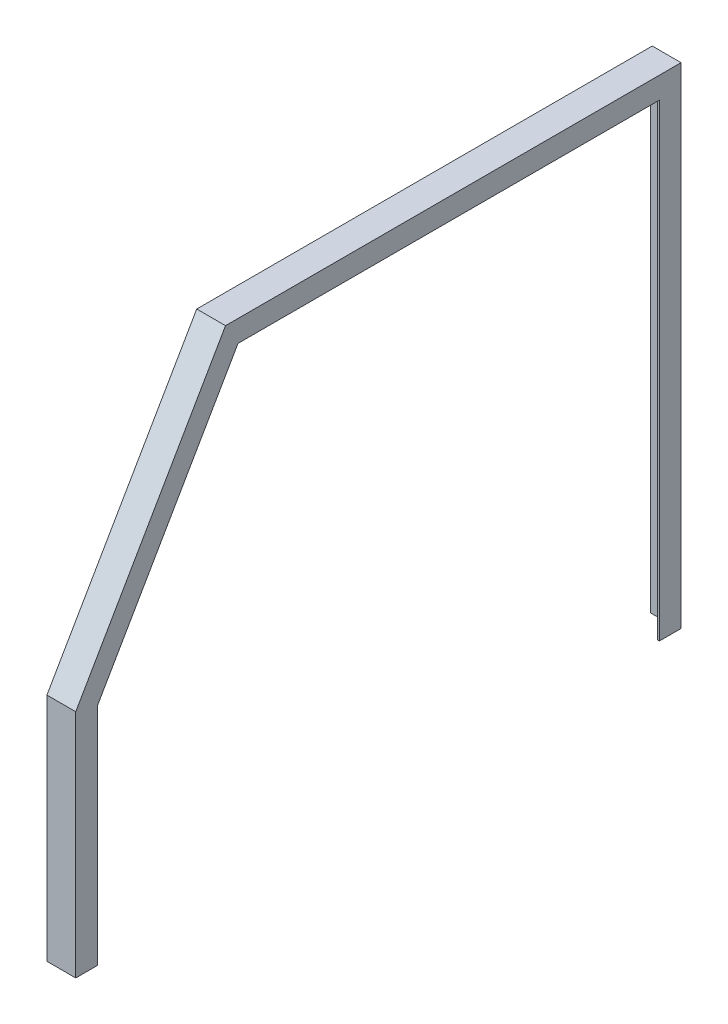
ISO-10303-21;
HEADER;
FILE_DESCRIPTION(('STEP AP214'),'2;1');
FILE_NAME('part.step','',(''),(''),'','','');
FILE_SCHEMA(('AUTOMOTIVE_DESIGN { 1 0 10303 214 1 1 1 1 }'));
ENDSEC;
DATA;
#1=APPLICATION_CONTEXT('core data for automotive mechanical design processes');
#2=APPLICATION_PROTOCOL_DEFINITION('international standard','automotive_design',2000,#1);
#3=PRODUCT_CONTEXT('',#1,'mechanical');
#4=PRODUCT('Part','Part','',(#3));
#5=PRODUCT_RELATED_PRODUCT_CATEGORY('part','',(#4));
#6=PRODUCT_DEFINITION_FORMATION('','',#4);
#7=PRODUCT_DEFINITION_CONTEXT('part definition',#1,'design');
#8=PRODUCT_DEFINITION('design','',#6,#7);
#9=PRODUCT_DEFINITION_SHAPE('','',#8);
#10=(LENGTH_UNIT() NAMED_UNIT(*) SI_UNIT(.MILLI.,.METRE.));
#11=(NAMED_UNIT(*) PLANE_ANGLE_UNIT() SI_UNIT($,.RADIAN.));
#12=(NAMED_UNIT(*) SI_UNIT($,.STERADIAN.) SOLID_ANGLE_UNIT());
#13=UNCERTAINTY_MEASURE_WITH_UNIT(LENGTH_MEASURE(1.E-05),#10,'distance_accuracy_value','');
#14=(GEOMETRIC_REPRESENTATION_CONTEXT(3) GLOBAL_UNCERTAINTY_ASSIGNED_CONTEXT((#13)) GLOBAL_UNIT_ASSIGNED_CONTEXT((#10,
#11,#12)) REPRESENTATION_CONTEXT('',''));
#15=CARTESIAN_POINT('',(0.,0.,0.));
#16=DIRECTION('',(0.,0.,1.));
#17=DIRECTION('',(1.,0.,0.));
#18=AXIS2_PLACEMENT_3D('',#15,#16,#17);
#19=CARTESIAN_POINT('',(3.175,0.,495.3));
#20=DIRECTION('',(0.,1.,0.));
#21=DIRECTION('',(0.,0.,1.));
#22=AXIS2_PLACEMENT_3D('',#19,#20,#21);
#23=PLANE('',#22);
#24=DIRECTION('',(-1.,0.,0.));
#25=VECTOR('',#24,1.);
#26=CARTESIAN_POINT('',(3.175,0.,533.4));
#27=LINE('',#26,#25);
#28=CARTESIAN_POINT('',(3.175,0.,533.4));
#29=VERTEX_POINT('',#28);
#30=CARTESIAN_POINT('',(-47.625,0.,533.4));
#31=VERTEX_POINT('',#30);
#32=EDGE_CURVE('E150',#29,#31,#27,.T.);
#33=ORIENTED_EDGE('',*,*,#32,.T.);
#34=DIRECTION('',(0.,0.,1.));
#35=VECTOR('',#34,1.);
#36=CARTESIAN_POINT('',(-47.625,0.,530.225));
#37=LINE('',#36,#35);
#38=CARTESIAN_POINT('',(-47.625,0.,530.225));
#39=VERTEX_POINT('',#38);
#40=EDGE_CURVE('E164',#39,#31,#37,.T.);
#41=ORIENTED_EDGE('',*,*,#40,.F.);
#42=DIRECTION('',(1.,0.,0.));
#43=VECTOR('',#42,1.);
#44=CARTESIAN_POINT('',(-47.625,0.,530.225));
#45=LINE('',#44,#43);
#46=CARTESIAN_POINT('',(0.,0.,530.225));
#47=VERTEX_POINT('',#46);
#48=EDGE_CURVE('E183',#39,#47,#45,.T.);
#49=ORIENTED_EDGE('',*,*,#48,.T.);
#50=DIRECTION('',(0.,0.,-1.));
#51=VECTOR('',#50,1.);
#52=CARTESIAN_POINT('',(0.,0.,495.3));
#53=LINE('',#52,#51);
#54=CARTESIAN_POINT('',(0.,0.,495.3));
#55=VERTEX_POINT('',#54);
#56=EDGE_CURVE('E238',#47,#55,#53,.T.);
#57=ORIENTED_EDGE('',*,*,#56,.T.);
#58=DIRECTION('',(-1.,0.,0.));
#59=VECTOR('',#58,1.);
#60=CARTESIAN_POINT('',(3.175,0.,495.3));
#61=LINE('',#60,#59);
#62=CARTESIAN_POINT('',(3.175,0.,495.3));
#63=VERTEX_POINT('',#62);
#64=EDGE_CURVE('E11',#63,#55,#61,.T.);
#65=ORIENTED_EDGE('',*,*,#64,.F.);
#66=DIRECTION('',(0.,0.,-1.));
#67=VECTOR('',#66,1.);
#68=CARTESIAN_POINT('',(3.175,0.,495.3));
#69=LINE('',#68,#67);
#70=EDGE_CURVE('E212',#29,#63,#69,.T.);
#71=ORIENTED_EDGE('',*,*,#70,.F.);
#72=EDGE_LOOP('',(#33,#41,#49,#57,#65,#71));
#73=FACE_BOUND('',#72,.T.);
#74=ADVANCED_FACE('F33',(#73),#23,.F.);
#75=CARTESIAN_POINT('',(3.175,0.,495.3));
#76=DIRECTION('',(0.,0.,1.));
#77=DIRECTION('',(1.,0.,0.));
#78=AXIS2_PLACEMENT_3D('',#75,#76,#77);
#79=PLANE('',#78);
#80=DIRECTION('',(0.,1.,0.));
#81=VECTOR('',#80,1.);
#82=CARTESIAN_POINT('',(0.,0.,495.3));
#83=LINE('',#82,#81);
#84=CARTESIAN_POINT('',(0.,396.191135768374,495.3));
#85=VERTEX_POINT('',#84);
#86=EDGE_CURVE('E235',#55,#85,#83,.T.);
#87=ORIENTED_EDGE('',*,*,#86,.T.);
#88=DIRECTION('',(-1.,0.,0.));
#89=VECTOR('',#88,1.);
#90=CARTESIAN_POINT('',(3.175,396.191135768374,495.3));
#91=LINE('',#90,#89);
#92=CARTESIAN_POINT('',(3.175,396.191135768374,495.3));
#93=VERTEX_POINT('',#92);
#94=EDGE_CURVE('E41',#93,#85,#91,.T.);
#95=ORIENTED_EDGE('',*,*,#94,.F.);
#96=DIRECTION('',(0.,1.,0.));
#97=VECTOR('',#96,1.);
#98=CARTESIAN_POINT('',(3.175,0.,495.3));
#99=LINE('',#98,#97);
#100=EDGE_CURVE('E215',#63,#93,#99,.T.);
#101=ORIENTED_EDGE('',*,*,#100,.F.);
#102=ORIENTED_EDGE('',*,*,#64,.T.);
#103=EDGE_LOOP('',(#87,#95,#101,#102));
#104=FACE_BOUND('',#103,.T.);
#105=ADVANCED_FACE('F278',(#104),#79,.F.);
#106=CARTESIAN_POINT('',(3.175,396.191135768374,495.3));
#107=DIRECTION('',(0.,0.500000000000001,0.866025403784438));
#108=DIRECTION('',(0.,-0.866025403784438,0.500000000000001));
#109=AXIS2_PLACEMENT_3D('',#106,#107,#108);
#110=PLANE('',#109);
#111=DIRECTION('',(0.,0.866025403784438,-0.500000000000001));
#112=VECTOR('',#111,1.);
#113=CARTESIAN_POINT('',(0.,396.191135768374,495.3));
#114=LINE('',#113,#112);
#115=CARTESIAN_POINT('',(0.,825.5,247.438411670378));
#116=VERTEX_POINT('',#115);
#117=EDGE_CURVE('E271',#85,#116,#114,.T.);
#118=ORIENTED_EDGE('',*,*,#117,.T.);
#119=DIRECTION('',(-1.,0.,0.));
#120=VECTOR('',#119,1.);
#121=CARTESIAN_POINT('',(3.175,825.5,247.438411670378));
#122=LINE('',#121,#120);
#123=CARTESIAN_POINT('',(3.175,825.5,247.438411670378));
#124=VERTEX_POINT('',#123);
#125=EDGE_CURVE('E262',#124,#116,#122,.T.);
#126=ORIENTED_EDGE('',*,*,#125,.F.);
#127=DIRECTION('',(0.,0.866025403784438,-0.500000000000001));
#128=VECTOR('',#127,1.);
#129=CARTESIAN_POINT('',(3.175,396.191135768374,495.3));
#130=LINE('',#129,#128);
#131=EDGE_CURVE('E218',#93,#124,#130,.T.);
#132=ORIENTED_EDGE('',*,*,#131,.F.);
#133=ORIENTED_EDGE('',*,*,#94,.T.);
#134=EDGE_LOOP('',(#118,#126,#132,#133));
#135=FACE_BOUND('',#134,.T.);
#136=ADVANCED_FACE('F269',(#135),#110,.F.);
#137=CARTESIAN_POINT('',(3.175,825.5,247.438411670378));
#138=DIRECTION('',(0.,1.,0.));
#139=DIRECTION('',(0.,0.,1.));
#140=AXIS2_PLACEMENT_3D('',#137,#138,#139);
#141=PLANE('',#140);
#142=DIRECTION('',(0.,0.,-1.));
#143=VECTOR('',#142,1.);
#144=CARTESIAN_POINT('',(0.,825.5,247.438411670378));
#145=LINE('',#144,#143);
#146=CARTESIAN_POINT('',(0.,825.5,-495.3));
#147=VERTEX_POINT('',#146);
#148=EDGE_CURVE('E277',#116,#147,#145,.T.);
#149=ORIENTED_EDGE('',*,*,#148,.T.);
#150=DIRECTION('',(-1.,0.,0.));
#151=VECTOR('',#150,1.);
#152=CARTESIAN_POINT('',(3.175,825.5,-495.3));
#153=LINE('',#152,#151);
#154=CARTESIAN_POINT('',(3.175,825.5,-495.3));
#155=VERTEX_POINT('',#154);
#156=EDGE_CURVE('E259',#155,#147,#153,.T.);
#157=ORIENTED_EDGE('',*,*,#156,.F.);
#158=DIRECTION('',(0.,0.,-1.));
#159=VECTOR('',#158,1.);
#160=CARTESIAN_POINT('',(3.175,825.5,247.438411670378));
#161=LINE('',#160,#159);
#162=EDGE_CURVE('E220',#124,#155,#161,.T.);
#163=ORIENTED_EDGE('',*,*,#162,.F.);
#164=ORIENTED_EDGE('',*,*,#125,.T.);
#165=EDGE_LOOP('',(#149,#157,#163,#164));
#166=FACE_BOUND('',#165,.T.);
#167=ADVANCED_FACE('F304',(#166),#141,.F.);
#168=CARTESIAN_POINT('',(3.175,825.5,-495.3));
#169=DIRECTION('',(0.,0.,-1.));
#170=DIRECTION('',(0.,1.,0.));
#171=AXIS2_PLACEMENT_3D('',#168,#169,#170);
#172=PLANE('',#171);
#173=DIRECTION('',(0.,-1.,0.));
#174=VECTOR('',#173,1.);
#175=CARTESIAN_POINT('',(0.,825.5,-495.3));
#176=LINE('',#175,#174);
#177=CARTESIAN_POINT('',(0.,0.,-495.3));
#178=VERTEX_POINT('',#177);
#179=EDGE_CURVE('E244',#147,#178,#176,.T.);
#180=ORIENTED_EDGE('',*,*,#179,.T.);
#181=DIRECTION('',(-1.,0.,0.));
#182=VECTOR('',#181,1.);
#183=CARTESIAN_POINT('',(3.175,0.,-495.3));
#184=LINE('',#183,#182);
#185=CARTESIAN_POINT('',(3.175,0.,-495.3));
#186=VERTEX_POINT('',#185);
#187=EDGE_CURVE('E256',#186,#178,#184,.T.);
#188=ORIENTED_EDGE('',*,*,#187,.F.);
#189=DIRECTION('',(0.,-1.,0.));
#190=VECTOR('',#189,1.);
#191=CARTESIAN_POINT('',(3.175,825.5,-495.3));
#192=LINE('',#191,#190);
#193=EDGE_CURVE('E222',#155,#186,#192,.T.);
#194=ORIENTED_EDGE('',*,*,#193,.F.);
#195=ORIENTED_EDGE('',*,*,#156,.T.);
#196=EDGE_LOOP('',(#180,#188,#194,#195));
#197=FACE_BOUND('',#196,.T.);
#198=ADVANCED_FACE('F309',(#197),#172,.F.);
#199=CARTESIAN_POINT('',(3.175,0.,-533.4));
#200=DIRECTION('',(0.,1.,0.));
#201=DIRECTION('',(0.,0.,1.));
#202=AXIS2_PLACEMENT_3D('',#199,#200,#201);
#203=PLANE('',#202);
#204=DIRECTION('',(0.,0.,-1.));
#205=VECTOR('',#204,1.);
#206=CARTESIAN_POINT('',(0.,0.,-533.4));
#207=LINE('',#206,#205);
#208=CARTESIAN_POINT('',(0.,0.,-530.225));
#209=VERTEX_POINT('',#208);
#210=EDGE_CURVE('E216',#178,#209,#207,.T.);
#211=ORIENTED_EDGE('',*,*,#210,.T.);
#212=DIRECTION('',(1.,0.,0.));
#213=VECTOR('',#212,1.);
#214=CARTESIAN_POINT('',(-47.625,0.,-530.225));
#215=LINE('',#214,#213);
#216=CARTESIAN_POINT('',(-47.625,0.,-530.225));
#217=VERTEX_POINT('',#216);
#218=EDGE_CURVE('E209',#217,#209,#215,.T.);
#219=ORIENTED_EDGE('',*,*,#218,.F.);
#220=DIRECTION('',(0.,0.,1.));
#221=VECTOR('',#220,1.);
#222=CARTESIAN_POINT('',(-47.625,0.,-533.4));
#223=LINE('',#222,#221);
#224=CARTESIAN_POINT('',(-47.625,0.,-533.4));
#225=VERTEX_POINT('',#224);
#226=EDGE_CURVE('E172',#225,#217,#223,.T.);
#227=ORIENTED_EDGE('',*,*,#226,.F.);
#228=DIRECTION('',(-1.,0.,0.));
#229=VECTOR('',#228,1.);
#230=CARTESIAN_POINT('',(3.175,0.,-533.4));
#231=LINE('',#230,#229);
#232=CARTESIAN_POINT('',(3.175,0.,-533.4));
#233=VERTEX_POINT('',#232);
#234=EDGE_CURVE('E254',#233,#225,#231,.T.);
#235=ORIENTED_EDGE('',*,*,#234,.F.);
#236=DIRECTION('',(0.,0.,-1.));
#237=VECTOR('',#236,1.);
#238=CARTESIAN_POINT('',(3.175,0.,-533.4));
#239=LINE('',#238,#237);
#240=EDGE_CURVE('E224',#186,#233,#239,.T.);
#241=ORIENTED_EDGE('',*,*,#240,.F.);
#242=ORIENTED_EDGE('',*,*,#187,.T.);
#243=EDGE_LOOP('',(#211,#219,#227,#235,#241,#242));
#244=FACE_BOUND('',#243,.T.);
#245=ADVANCED_FACE('F313',(#244),#203,.F.);
#246=CARTESIAN_POINT('',(3.175,863.6,-533.4));
#247=DIRECTION('',(0.,0.,1.));
#248=DIRECTION('',(1.,0.,0.));
#249=AXIS2_PLACEMENT_3D('',#246,#247,#248);
#250=PLANE('',#249);
#251=ORIENTED_EDGE('',*,*,#234,.T.);
#252=DIRECTION('',(0.,-1.,0.));
#253=VECTOR('',#252,1.);
#254=CARTESIAN_POINT('',(-47.625,863.6,-533.4));
#255=LINE('',#254,#253);
#256=CARTESIAN_POINT('',(-47.625,863.6,-533.4));
#257=VERTEX_POINT('',#256);
#258=EDGE_CURVE('E169',#257,#225,#255,.T.);
#259=ORIENTED_EDGE('',*,*,#258,.F.);
#260=DIRECTION('',(-1.,0.,0.));
#261=VECTOR('',#260,1.);
#262=CARTESIAN_POINT('',(3.175,863.6,-533.4));
#263=LINE('',#262,#261);
#264=CARTESIAN_POINT('',(3.175,863.6,-533.4));
#265=VERTEX_POINT('',#264);
#266=EDGE_CURVE('E252',#265,#257,#263,.T.);
#267=ORIENTED_EDGE('',*,*,#266,.F.);
#268=DIRECTION('',(0.,1.,0.));
#269=VECTOR('',#268,1.);
#270=CARTESIAN_POINT('',(3.175,863.6,-533.4));
#271=LINE('',#270,#269);
#272=EDGE_CURVE('E226',#233,#265,#271,.T.);
#273=ORIENTED_EDGE('',*,*,#272,.F.);
#274=EDGE_LOOP('',(#251,#259,#267,#273));
#275=FACE_BOUND('',#274,.T.);
#276=ADVANCED_FACE('F316',(#275),#250,.F.);
#277=CARTESIAN_POINT('',(3.175,863.6,269.435456926503));
#278=DIRECTION('',(0.,-1.,0.));
#279=DIRECTION('',(0.,0.,-1.));
#280=AXIS2_PLACEMENT_3D('',#277,#278,#279);
#281=PLANE('',#280);
#282=ORIENTED_EDGE('',*,*,#266,.T.);
#283=DIRECTION('',(0.,0.,-1.));
#284=VECTOR('',#283,1.);
#285=CARTESIAN_POINT('',(-47.625,863.6,269.435456926503));
#286=LINE('',#285,#284);
#287=CARTESIAN_POINT('',(-47.625,863.6,269.435456926503));
#288=VERTEX_POINT('',#287);
#289=EDGE_CURVE('E159',#288,#257,#286,.T.);
#290=ORIENTED_EDGE('',*,*,#289,.F.);
#291=DIRECTION('',(-1.,0.,0.));
#292=VECTOR('',#291,1.);
#293=CARTESIAN_POINT('',(3.175,863.6,269.435456926503));
#294=LINE('',#293,#292);
#295=CARTESIAN_POINT('',(3.175,863.6,269.435456926503));
#296=VERTEX_POINT('',#295);
#297=EDGE_CURVE('E149',#296,#288,#294,.T.);
#298=ORIENTED_EDGE('',*,*,#297,.F.);
#299=DIRECTION('',(0.,0.,1.));
#300=VECTOR('',#299,1.);
#301=CARTESIAN_POINT('',(3.175,863.6,269.435456926503));
#302=LINE('',#301,#300);
#303=EDGE_CURVE('E228',#265,#296,#302,.T.);
#304=ORIENTED_EDGE('',*,*,#303,.F.);
#305=EDGE_LOOP('',(#282,#290,#298,#304));
#306=FACE_BOUND('',#305,.T.);
#307=ADVANCED_FACE('F320',(#306),#281,.F.);
#308=CARTESIAN_POINT('',(3.175,406.4,533.4));
#309=DIRECTION('',(0.,-0.500000000000001,-0.866025403784438));
#310=DIRECTION('',(0.,0.866025403784438,-0.500000000000001));
#311=AXIS2_PLACEMENT_3D('',#308,#309,#310);
#312=PLANE('',#311);
#313=ORIENTED_EDGE('',*,*,#297,.T.);
#314=DIRECTION('',(0.,0.866025403784438,-0.500000000000001));
#315=VECTOR('',#314,1.);
#316=CARTESIAN_POINT('',(-47.625,406.4,533.4));
#317=LINE('',#316,#315);
#318=CARTESIAN_POINT('',(-47.625,406.4,533.4));
#319=VERTEX_POINT('',#318);
#320=EDGE_CURVE('E153',#319,#288,#317,.T.);
#321=ORIENTED_EDGE('',*,*,#320,.F.);
#322=DIRECTION('',(-1.,0.,0.));
#323=VECTOR('',#322,1.);
#324=CARTESIAN_POINT('',(3.175,406.4,533.4));
#325=LINE('',#324,#323);
#326=CARTESIAN_POINT('',(3.175,406.4,533.4));
#327=VERTEX_POINT('',#326);
#328=EDGE_CURVE('E140',#327,#319,#325,.T.);
#329=ORIENTED_EDGE('',*,*,#328,.F.);
#330=DIRECTION('',(0.,-0.866025403784438,0.500000000000001));
#331=VECTOR('',#330,1.);
#332=CARTESIAN_POINT('',(3.175,406.4,533.4));
#333=LINE('',#332,#331);
#334=EDGE_CURVE('E230',#296,#327,#333,.T.);
#335=ORIENTED_EDGE('',*,*,#334,.F.);
#336=EDGE_LOOP('',(#313,#321,#329,#335));
#337=FACE_BOUND('',#336,.T.);
#338=ADVANCED_FACE('F154',(#337),#312,.F.);
#339=CARTESIAN_POINT('',(3.175,0.,533.4));
#340=DIRECTION('',(0.,0.,-1.));
#341=DIRECTION('',(-1.,0.,0.));
#342=AXIS2_PLACEMENT_3D('',#339,#340,#341);
#343=PLANE('',#342);
#344=ORIENTED_EDGE('',*,*,#328,.T.);
#345=DIRECTION('',(0.,1.,0.));
#346=VECTOR('',#345,1.);
#347=CARTESIAN_POINT('',(-47.625,0.,533.4));
#348=LINE('',#347,#346);
#349=EDGE_CURVE('E145',#31,#319,#348,.T.);
#350=ORIENTED_EDGE('',*,*,#349,.F.);
#351=ORIENTED_EDGE('',*,*,#32,.F.);
#352=DIRECTION('',(0.,-1.,0.));
#353=VECTOR('',#352,1.);
#354=CARTESIAN_POINT('',(3.175,0.,533.4));
#355=LINE('',#354,#353);
#356=EDGE_CURVE('E146',#327,#29,#355,.T.);
#357=ORIENTED_EDGE('',*,*,#356,.F.);
#358=EDGE_LOOP('',(#344,#350,#351,#357));
#359=FACE_BOUND('',#358,.T.);
#360=ADVANCED_FACE('F142',(#359),#343,.F.);
#361=CARTESIAN_POINT('',(3.175,0.,0.));
#362=DIRECTION('',(-1.,0.,0.));
#363=DIRECTION('',(0.,0.,1.));
#364=AXIS2_PLACEMENT_3D('',#361,#362,#363);
#365=PLANE('',#364);
#366=ORIENTED_EDGE('',*,*,#70,.T.);
#367=ORIENTED_EDGE('',*,*,#100,.T.);
#368=ORIENTED_EDGE('',*,*,#131,.T.);
#369=ORIENTED_EDGE('',*,*,#162,.T.);
#370=ORIENTED_EDGE('',*,*,#193,.T.);
#371=ORIENTED_EDGE('',*,*,#240,.T.);
#372=ORIENTED_EDGE('',*,*,#272,.T.);
#373=ORIENTED_EDGE('',*,*,#303,.T.);
#374=ORIENTED_EDGE('',*,*,#334,.T.);
#375=ORIENTED_EDGE('',*,*,#356,.T.);
#376=EDGE_LOOP('',(#366,#367,#368,#369,#370,#371,#372,#373,#374,#375));
#377=FACE_BOUND('',#376,.T.);
#378=ADVANCED_FACE('F329',(#377),#365,.F.);
#379=CARTESIAN_POINT('',(0.,0.,0.));
#380=DIRECTION('',(-1.,0.,0.));
#381=DIRECTION('',(0.,0.,1.));
#382=AXIS2_PLACEMENT_3D('',#379,#380,#381);
#383=PLANE('',#382);
#384=DIRECTION('',(0.,-1.,0.));
#385=VECTOR('',#384,1.);
#386=CARTESIAN_POINT('',(0.,0.,530.225));
#387=LINE('',#386,#385);
#388=CARTESIAN_POINT('',(0.,405.549261314031,530.225));
#389=VERTEX_POINT('',#388);
#390=EDGE_CURVE('E49',#389,#47,#387,.T.);
#391=ORIENTED_EDGE('',*,*,#390,.F.);
#392=DIRECTION('',(0.,-0.866025403784439,0.5));
#393=VECTOR('',#392,1.);
#394=CARTESIAN_POINT('',(0.,405.549261314031,530.225));
#395=LINE('',#394,#393);
#396=CARTESIAN_POINT('',(0.,860.425,267.602369821826));
#397=VERTEX_POINT('',#396);
#398=EDGE_CURVE('E53',#397,#389,#395,.T.);
#399=ORIENTED_EDGE('',*,*,#398,.F.);
#400=DIRECTION('',(0.,0.,1.));
#401=VECTOR('',#400,1.);
#402=CARTESIAN_POINT('',(0.,860.425,267.602369821826));
#403=LINE('',#402,#401);
#404=CARTESIAN_POINT('',(0.,860.425,-530.225));
#405=VERTEX_POINT('',#404);
#406=EDGE_CURVE('E184',#405,#397,#403,.T.);
#407=ORIENTED_EDGE('',*,*,#406,.F.);
#408=DIRECTION('',(0.,1.,0.));
#409=VECTOR('',#408,1.);
#410=CARTESIAN_POINT('',(0.,860.425,-530.225));
#411=LINE('',#410,#409);
#412=EDGE_CURVE('E186',#209,#405,#411,.T.);
#413=ORIENTED_EDGE('',*,*,#412,.F.);
#414=ORIENTED_EDGE('',*,*,#210,.F.);
#415=ORIENTED_EDGE('',*,*,#179,.F.);
#416=ORIENTED_EDGE('',*,*,#148,.F.);
#417=ORIENTED_EDGE('',*,*,#117,.F.);
#418=ORIENTED_EDGE('',*,*,#86,.F.);
#419=ORIENTED_EDGE('',*,*,#56,.F.);
#420=EDGE_LOOP('',(#391,#399,#407,#413,#414,#415,#416,#417,#418,#419));
#421=FACE_BOUND('',#420,.T.);
#422=ADVANCED_FACE('F275',(#421),#383,.T.);
#423=CARTESIAN_POINT('',(-47.625,860.425,-530.225));
#424=DIRECTION('',(0.,0.,-1.));
#425=DIRECTION('',(-1.,0.,0.));
#426=AXIS2_PLACEMENT_3D('',#423,#424,#425);
#427=PLANE('',#426);
#428=ORIENTED_EDGE('',*,*,#412,.T.);
#429=DIRECTION('',(1.,0.,0.));
#430=VECTOR('',#429,1.);
#431=CARTESIAN_POINT('',(-47.625,860.425,-530.225));
#432=LINE('',#431,#430);
#433=CARTESIAN_POINT('',(-47.625,860.425,-530.225));
#434=VERTEX_POINT('',#433);
#435=EDGE_CURVE('E204',#434,#405,#432,.T.);
#436=ORIENTED_EDGE('',*,*,#435,.F.);
#437=DIRECTION('',(0.,1.,0.));
#438=VECTOR('',#437,1.);
#439=CARTESIAN_POINT('',(-47.625,860.425,-530.225));
#440=LINE('',#439,#438);
#441=EDGE_CURVE('E174',#217,#434,#440,.T.);
#442=ORIENTED_EDGE('',*,*,#441,.F.);
#443=ORIENTED_EDGE('',*,*,#218,.T.);
#444=EDGE_LOOP('',(#428,#436,#442,#443));
#445=FACE_BOUND('',#444,.T.);
#446=ADVANCED_FACE('F292',(#445),#427,.F.);
#447=CARTESIAN_POINT('',(-47.625,860.425,267.602369821826));
#448=DIRECTION('',(0.,1.,0.));
#449=DIRECTION('',(0.,0.,1.));
#450=AXIS2_PLACEMENT_3D('',#447,#448,#449);
#451=PLANE('',#450);
#452=ORIENTED_EDGE('',*,*,#406,.T.);
#453=DIRECTION('',(1.,0.,0.));
#454=VECTOR('',#453,1.);
#455=CARTESIAN_POINT('',(-47.625,860.425,267.602369821826));
#456=LINE('',#455,#454);
#457=CARTESIAN_POINT('',(-47.625,860.425,267.602369821826));
#458=VERTEX_POINT('',#457);
#459=EDGE_CURVE('E199',#458,#397,#456,.T.);
#460=ORIENTED_EDGE('',*,*,#459,.F.);
#461=DIRECTION('',(0.,0.,1.));
#462=VECTOR('',#461,1.);
#463=CARTESIAN_POINT('',(-47.625,860.425,267.602369821826));
#464=LINE('',#463,#462);
#465=EDGE_CURVE('E176',#434,#458,#464,.T.);
#466=ORIENTED_EDGE('',*,*,#465,.F.);
#467=ORIENTED_EDGE('',*,*,#435,.T.);
#468=EDGE_LOOP('',(#452,#460,#466,#467));
#469=FACE_BOUND('',#468,.T.);
#470=ADVANCED_FACE('F285',(#469),#451,.F.);
#471=CARTESIAN_POINT('',(-47.625,405.549261314031,530.225));
#472=DIRECTION('',(0.,0.5,0.866025403784439));
#473=DIRECTION('',(0.,-0.866025403784439,0.5));
#474=AXIS2_PLACEMENT_3D('',#471,#472,#473);
#475=PLANE('',#474);
#476=ORIENTED_EDGE('',*,*,#398,.T.);
#477=DIRECTION('',(1.,0.,0.));
#478=VECTOR('',#477,1.);
#479=CARTESIAN_POINT('',(-47.625,405.549261314031,530.225));
#480=LINE('',#479,#478);
#481=CARTESIAN_POINT('',(-47.625,405.549261314031,530.225));
#482=VERTEX_POINT('',#481);
#483=EDGE_CURVE('E190',#482,#389,#480,.T.);
#484=ORIENTED_EDGE('',*,*,#483,.F.);
#485=DIRECTION('',(0.,-0.866025403784439,0.5));
#486=VECTOR('',#485,1.);
#487=CARTESIAN_POINT('',(-47.625,405.549261314031,530.225));
#488=LINE('',#487,#486);
#489=EDGE_CURVE('E178',#458,#482,#488,.T.);
#490=ORIENTED_EDGE('',*,*,#489,.F.);
#491=ORIENTED_EDGE('',*,*,#459,.T.);
#492=EDGE_LOOP('',(#476,#484,#490,#491));
#493=FACE_BOUND('',#492,.T.);
#494=ADVANCED_FACE('F283',(#493),#475,.F.);
#495=CARTESIAN_POINT('',(-47.625,0.,530.225));
#496=DIRECTION('',(0.,0.,1.));
#497=DIRECTION('',(1.,0.,0.));
#498=AXIS2_PLACEMENT_3D('',#495,#496,#497);
#499=PLANE('',#498);
#500=ORIENTED_EDGE('',*,*,#390,.T.);
#501=ORIENTED_EDGE('',*,*,#48,.F.);
#502=DIRECTION('',(0.,-1.,0.));
#503=VECTOR('',#502,1.);
#504=CARTESIAN_POINT('',(-47.625,0.,530.225));
#505=LINE('',#504,#503);
#506=EDGE_CURVE('E180',#482,#39,#505,.T.);
#507=ORIENTED_EDGE('',*,*,#506,.F.);
#508=ORIENTED_EDGE('',*,*,#483,.T.);
#509=EDGE_LOOP('',(#500,#501,#507,#508));
#510=FACE_BOUND('',#509,.T.);
#511=ADVANCED_FACE('F281',(#510),#499,.F.);
#512=CARTESIAN_POINT('',(-47.625,0.,0.));
#513=DIRECTION('',(-1.,0.,0.));
#514=DIRECTION('',(0.,0.,1.));
#515=AXIS2_PLACEMENT_3D('',#512,#513,#514);
#516=PLANE('',#515);
#517=ORIENTED_EDGE('',*,*,#349,.T.);
#518=ORIENTED_EDGE('',*,*,#320,.T.);
#519=ORIENTED_EDGE('',*,*,#289,.T.);
#520=ORIENTED_EDGE('',*,*,#258,.T.);
#521=ORIENTED_EDGE('',*,*,#226,.T.);
#522=ORIENTED_EDGE('',*,*,#441,.T.);
#523=ORIENTED_EDGE('',*,*,#465,.T.);
#524=ORIENTED_EDGE('',*,*,#489,.T.);
#525=ORIENTED_EDGE('',*,*,#506,.T.);
#526=ORIENTED_EDGE('',*,*,#40,.T.);
#527=EDGE_LOOP('',(#517,#518,#519,#520,#521,#522,#523,#524,#525,#526));
#528=FACE_BOUND('',#527,.T.);
#529=ADVANCED_FACE('F162',(#528),#516,.T.);
#530=CLOSED_SHELL('',(#74,#105,#136,#167,#198,#245,#276,#307,#338,#360,#378,#422,#446,#470,#494,
#511,#529));
#531=MANIFOLD_SOLID_BREP('B2',#530);
#532=ADVANCED_BREP_SHAPE_REPRESENTATION('',(#18,#531),#14);
#533=SHAPE_DEFINITION_REPRESENTATION(#9,#532);
ENDSEC;
END-ISO-10303-21;
